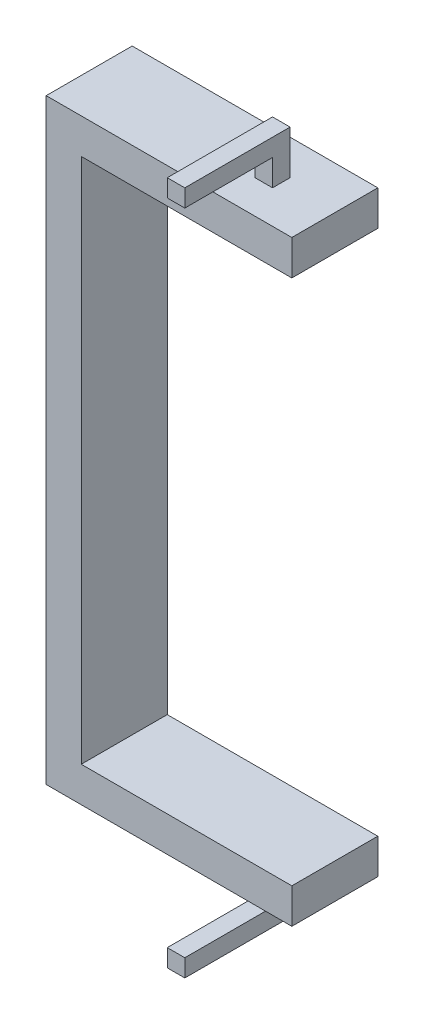
ISO-10303-21;
HEADER;
FILE_DESCRIPTION(('STEP AP214'),'2;1');
FILE_NAME('part.step','',(''),(''),'','','');
FILE_SCHEMA(('AUTOMOTIVE_DESIGN { 1 0 10303 214 1 1 1 1 }'));
ENDSEC;
DATA;
#1=APPLICATION_CONTEXT('core data for automotive mechanical design processes');
#2=APPLICATION_PROTOCOL_DEFINITION('international standard','automotive_design',2000,#1);
#3=PRODUCT_CONTEXT('',#1,'mechanical');
#4=PRODUCT('Part','Part','',(#3));
#5=PRODUCT_RELATED_PRODUCT_CATEGORY('part','',(#4));
#6=PRODUCT_DEFINITION_FORMATION('','',#4);
#7=PRODUCT_DEFINITION_CONTEXT('part definition',#1,'design');
#8=PRODUCT_DEFINITION('design','',#6,#7);
#9=PRODUCT_DEFINITION_SHAPE('','',#8);
#10=(LENGTH_UNIT() NAMED_UNIT(*) SI_UNIT(.MILLI.,.METRE.));
#11=(NAMED_UNIT(*) PLANE_ANGLE_UNIT() SI_UNIT($,.RADIAN.));
#12=(NAMED_UNIT(*) SI_UNIT($,.STERADIAN.) SOLID_ANGLE_UNIT());
#13=UNCERTAINTY_MEASURE_WITH_UNIT(LENGTH_MEASURE(1.E-05),#10,'distance_accuracy_value','');
#14=(GEOMETRIC_REPRESENTATION_CONTEXT(3) GLOBAL_UNCERTAINTY_ASSIGNED_CONTEXT((#13)) GLOBAL_UNIT_ASSIGNED_CONTEXT((#10,
#11,#12)) REPRESENTATION_CONTEXT('',''));
#15=CARTESIAN_POINT('',(0.,0.,0.));
#16=DIRECTION('',(0.,0.,1.));
#17=DIRECTION('',(1.,0.,0.));
#18=AXIS2_PLACEMENT_3D('',#15,#16,#17);
#19=CARTESIAN_POINT('',(0.,170.,-59.9999999999997));
#20=DIRECTION('',(0.,0.,1.));
#21=DIRECTION('',(1.,0.,0.));
#22=AXIS2_PLACEMENT_3D('',#19,#20,#21);
#23=PLANE('',#22);
#24=DIRECTION('',(0.,1.,0.));
#25=VECTOR('',#24,1.);
#26=CARTESIAN_POINT('',(140.,-160.,-59.9999999999997));
#27=LINE('',#26,#25);
#28=CARTESIAN_POINT('',(140.,-170.,-59.9999999999997));
#29=VERTEX_POINT('',#28);
#30=CARTESIAN_POINT('',(140.,-150.,-59.9999999999997));
#31=VERTEX_POINT('',#30);
#32=EDGE_CURVE('E46',#29,#31,#27,.T.);
#33=ORIENTED_EDGE('',*,*,#32,.F.);
#34=DIRECTION('',(1.,0.,0.));
#35=VECTOR('',#34,1.);
#36=CARTESIAN_POINT('',(70.,-170.,-59.9999999999997));
#37=LINE('',#36,#35);
#38=CARTESIAN_POINT('',(0.,-170.,-59.9999999999998));
#39=VERTEX_POINT('',#38);
#40=EDGE_CURVE('E190',#39,#29,#37,.T.);
#41=ORIENTED_EDGE('',*,*,#40,.F.);
#42=DIRECTION('',(0.,1.,0.));
#43=VECTOR('',#42,1.);
#44=CARTESIAN_POINT('',(0.,0.,-59.9999999999997));
#45=LINE('',#44,#43);
#46=CARTESIAN_POINT('',(0.,170.,-59.9999999999997));
#47=VERTEX_POINT('',#46);
#48=EDGE_CURVE('E196',#39,#47,#45,.T.);
#49=ORIENTED_EDGE('',*,*,#48,.T.);
#50=DIRECTION('',(1.,0.,0.));
#51=VECTOR('',#50,1.);
#52=CARTESIAN_POINT('',(70.,170.,-59.9999999999997));
#53=LINE('',#52,#51);
#54=CARTESIAN_POINT('',(140.,170.,-59.9999999999997));
#55=VERTEX_POINT('',#54);
#56=EDGE_CURVE('E210',#47,#55,#53,.T.);
#57=ORIENTED_EDGE('',*,*,#56,.T.);
#58=DIRECTION('',(0.,1.,0.));
#59=VECTOR('',#58,1.);
#60=CARTESIAN_POINT('',(140.,160.,-59.9999999999997));
#61=LINE('',#60,#59);
#62=CARTESIAN_POINT('',(140.,150.,-59.9999999999996));
#63=VERTEX_POINT('',#62);
#64=EDGE_CURVE('E220',#63,#55,#61,.T.);
#65=ORIENTED_EDGE('',*,*,#64,.F.);
#66=DIRECTION('',(1.,0.,0.));
#67=VECTOR('',#66,1.);
#68=CARTESIAN_POINT('',(80.,150.,-59.9999999999997));
#69=LINE('',#68,#67);
#70=CARTESIAN_POINT('',(20.,150.,-59.9999999999997));
#71=VERTEX_POINT('',#70);
#72=EDGE_CURVE('E223',#71,#63,#69,.T.);
#73=ORIENTED_EDGE('',*,*,#72,.F.);
#74=DIRECTION('',(0.,1.,0.));
#75=VECTOR('',#74,1.);
#76=CARTESIAN_POINT('',(20.,0.,-59.9999999999997));
#77=LINE('',#76,#75);
#78=CARTESIAN_POINT('',(20.,-150.,-59.9999999999997));
#79=VERTEX_POINT('',#78);
#80=EDGE_CURVE('E228',#79,#71,#77,.T.);
#81=ORIENTED_EDGE('',*,*,#80,.F.);
#82=DIRECTION('',(1.,0.,0.));
#83=VECTOR('',#82,1.);
#84=CARTESIAN_POINT('',(80.,-150.,-59.9999999999997));
#85=LINE('',#84,#83);
#86=EDGE_CURVE('E221',#79,#31,#85,.T.);
#87=ORIENTED_EDGE('',*,*,#86,.T.);
#88=EDGE_LOOP('',(#33,#41,#49,#57,#65,#73,#81,#87));
#89=FACE_BOUND('',#88,.T.);
#90=ADVANCED_FACE('F38',(#89),#23,.F.);
#91=CARTESIAN_POINT('',(140.,0.,0.));
#92=DIRECTION('',(1.,0.,0.));
#93=DIRECTION('',(0.,0.,-1.));
#94=AXIS2_PLACEMENT_3D('',#91,#92,#93);
#95=PLANE('',#94);
#96=DIRECTION('',(0.,1.,0.));
#97=VECTOR('',#96,1.);
#98=CARTESIAN_POINT('',(140.,0.,-10.9999999999997));
#99=LINE('',#98,#97);
#100=CARTESIAN_POINT('',(140.,-170.,-10.9999999999997));
#101=VERTEX_POINT('',#100);
#102=CARTESIAN_POINT('',(140.,-150.,-10.9999999999997));
#103=VERTEX_POINT('',#102);
#104=EDGE_CURVE('E173',#101,#103,#99,.T.);
#105=ORIENTED_EDGE('',*,*,#104,.F.);
#106=DIRECTION('',(0.,0.,-1.));
#107=VECTOR('',#106,1.);
#108=CARTESIAN_POINT('',(140.,-170.,-19.9999999999997));
#109=LINE('',#108,#107);
#110=EDGE_CURVE('E182',#101,#29,#109,.T.);
#111=ORIENTED_EDGE('',*,*,#110,.T.);
#112=ORIENTED_EDGE('',*,*,#32,.T.);
#113=DIRECTION('',(0.,0.,1.));
#114=VECTOR('',#113,1.);
#115=CARTESIAN_POINT('',(140.,-150.,-19.9999999999997));
#116=LINE('',#115,#114);
#117=EDGE_CURVE('E185',#31,#103,#116,.T.);
#118=ORIENTED_EDGE('',*,*,#117,.T.);
#119=EDGE_LOOP('',(#105,#111,#112,#118));
#120=FACE_BOUND('',#119,.T.);
#121=ADVANCED_FACE('F180',(#120),#95,.T.);
#122=CARTESIAN_POINT('',(20.,-150.,60.0000000000004));
#123=DIRECTION('',(0.,-1.,0.));
#124=DIRECTION('',(0.,0.,-1.));
#125=AXIS2_PLACEMENT_3D('',#122,#123,#124);
#126=PLANE('',#125);
#127=DIRECTION('',(0.,0.,1.));
#128=VECTOR('',#127,1.);
#129=CARTESIAN_POINT('',(20.,-150.,-19.9999999999996));
#130=LINE('',#129,#128);
#131=CARTESIAN_POINT('',(20.,-150.,-10.9999999999997));
#132=VERTEX_POINT('',#131);
#133=EDGE_CURVE('E203',#79,#132,#130,.T.);
#134=ORIENTED_EDGE('',*,*,#133,.T.);
#135=DIRECTION('',(1.,0.,0.));
#136=VECTOR('',#135,1.);
#137=CARTESIAN_POINT('',(20.,-150.,-10.9999999999997));
#138=LINE('',#137,#136);
#139=EDGE_CURVE('E187',#132,#103,#138,.T.);
#140=ORIENTED_EDGE('',*,*,#139,.T.);
#141=ORIENTED_EDGE('',*,*,#117,.F.);
#142=ORIENTED_EDGE('',*,*,#86,.F.);
#143=EDGE_LOOP('',(#134,#140,#141,#142));
#144=FACE_BOUND('',#143,.T.);
#145=ADVANCED_FACE('F245',(#144),#126,.F.);
#146=CARTESIAN_POINT('',(20.,0.,0.));
#147=DIRECTION('',(1.,0.,0.));
#148=DIRECTION('',(0.,0.,-1.));
#149=AXIS2_PLACEMENT_3D('',#146,#147,#148);
#150=PLANE('',#149);
#151=DIRECTION('',(0.,1.,0.));
#152=VECTOR('',#151,1.);
#153=CARTESIAN_POINT('',(20.,0.,-10.9999999999997));
#154=LINE('',#153,#152);
#155=CARTESIAN_POINT('',(20.,150.,-10.9999999999997));
#156=VERTEX_POINT('',#155);
#157=EDGE_CURVE('E243',#132,#156,#154,.T.);
#158=ORIENTED_EDGE('',*,*,#157,.F.);
#159=ORIENTED_EDGE('',*,*,#133,.F.);
#160=ORIENTED_EDGE('',*,*,#80,.T.);
#161=DIRECTION('',(0.,0.,-1.));
#162=VECTOR('',#161,1.);
#163=CARTESIAN_POINT('',(20.,150.,-19.9999999999996));
#164=LINE('',#163,#162);
#165=EDGE_CURVE('E206',#156,#71,#164,.T.);
#166=ORIENTED_EDGE('',*,*,#165,.F.);
#167=EDGE_LOOP('',(#158,#159,#160,#166));
#168=FACE_BOUND('',#167,.T.);
#169=ADVANCED_FACE('F242',(#168),#150,.T.);
#170=CARTESIAN_POINT('',(20.,150.,60.0000000000004));
#171=DIRECTION('',(0.,-1.,0.));
#172=DIRECTION('',(0.,0.,-1.));
#173=AXIS2_PLACEMENT_3D('',#170,#171,#172);
#174=PLANE('',#173);
#175=DIRECTION('',(1.,0.,0.));
#176=VECTOR('',#175,1.);
#177=CARTESIAN_POINT('',(20.,150.,-10.9999999999997));
#178=LINE('',#177,#176);
#179=CARTESIAN_POINT('',(140.,150.,-10.9999999999997));
#180=VERTEX_POINT('',#179);
#181=EDGE_CURVE('E247',#156,#180,#178,.T.);
#182=ORIENTED_EDGE('',*,*,#181,.F.);
#183=ORIENTED_EDGE('',*,*,#165,.T.);
#184=ORIENTED_EDGE('',*,*,#72,.T.);
#185=DIRECTION('',(0.,0.,-1.));
#186=VECTOR('',#185,1.);
#187=CARTESIAN_POINT('',(140.,150.,-19.9999999999997));
#188=LINE('',#187,#186);
#189=EDGE_CURVE('E207',#180,#63,#188,.T.);
#190=ORIENTED_EDGE('',*,*,#189,.F.);
#191=EDGE_LOOP('',(#182,#183,#184,#190));
#192=FACE_BOUND('',#191,.T.);
#193=ADVANCED_FACE('F236',(#192),#174,.T.);
#194=CARTESIAN_POINT('',(140.,0.,0.));
#195=DIRECTION('',(1.,0.,0.));
#196=DIRECTION('',(0.,0.,-1.));
#197=AXIS2_PLACEMENT_3D('',#194,#195,#196);
#198=PLANE('',#197);
#199=DIRECTION('',(0.,1.,0.));
#200=VECTOR('',#199,1.);
#201=CARTESIAN_POINT('',(140.,0.,-10.9999999999997));
#202=LINE('',#201,#200);
#203=CARTESIAN_POINT('',(140.,170.,-10.9999999999997));
#204=VERTEX_POINT('',#203);
#205=EDGE_CURVE('E376',#180,#204,#202,.T.);
#206=ORIENTED_EDGE('',*,*,#205,.F.);
#207=ORIENTED_EDGE('',*,*,#189,.T.);
#208=ORIENTED_EDGE('',*,*,#64,.T.);
#209=DIRECTION('',(0.,0.,1.));
#210=VECTOR('',#209,1.);
#211=CARTESIAN_POINT('',(140.,170.,-19.9999999999998));
#212=LINE('',#211,#210);
#213=EDGE_CURVE('E211',#55,#204,#212,.T.);
#214=ORIENTED_EDGE('',*,*,#213,.T.);
#215=EDGE_LOOP('',(#206,#207,#208,#214));
#216=FACE_BOUND('',#215,.T.);
#217=ADVANCED_FACE('F368',(#216),#198,.T.);
#218=CARTESIAN_POINT('',(0.,170.,59.9999999999998));
#219=DIRECTION('',(0.,-1.,0.));
#220=DIRECTION('',(0.,0.,-1.));
#221=AXIS2_PLACEMENT_3D('',#218,#219,#220);
#222=PLANE('',#221);
#223=DIRECTION('',(-1.,0.,0.));
#224=VECTOR('',#223,1.);
#225=CARTESIAN_POINT('',(110.,170.,-39.9999999999998));
#226=LINE('',#225,#224);
#227=CARTESIAN_POINT('',(110.,170.,-39.9999999999998));
#228=VERTEX_POINT('',#227);
#229=CARTESIAN_POINT('',(100.,170.,-39.9999999999998));
#230=VERTEX_POINT('',#229);
#231=EDGE_CURVE('E328',#228,#230,#226,.T.);
#232=ORIENTED_EDGE('',*,*,#231,.F.);
#233=DIRECTION('',(0.,0.,1.));
#234=VECTOR('',#233,1.);
#235=CARTESIAN_POINT('',(110.,170.,-39.9999999999998));
#236=LINE('',#235,#234);
#237=CARTESIAN_POINT('',(110.,170.,-29.9999999999998));
#238=VERTEX_POINT('',#237);
#239=EDGE_CURVE('E306',#228,#238,#236,.T.);
#240=ORIENTED_EDGE('',*,*,#239,.T.);
#241=DIRECTION('',(-1.,0.,0.));
#242=VECTOR('',#241,1.);
#243=CARTESIAN_POINT('',(110.,170.,-29.9999999999998));
#244=LINE('',#243,#242);
#245=CARTESIAN_POINT('',(100.,170.,-29.9999999999998));
#246=VERTEX_POINT('',#245);
#247=EDGE_CURVE('E331',#238,#246,#244,.T.);
#248=ORIENTED_EDGE('',*,*,#247,.T.);
#249=DIRECTION('',(0.,0.,1.));
#250=VECTOR('',#249,1.);
#251=CARTESIAN_POINT('',(100.,170.,-39.9999999999998));
#252=LINE('',#251,#250);
#253=EDGE_CURVE('E322',#230,#246,#252,.T.);
#254=ORIENTED_EDGE('',*,*,#253,.F.);
#255=EDGE_LOOP('',(#232,#240,#248,#254));
#256=FACE_BOUND('',#255,.T.);
#257=DIRECTION('',(0.,0.,1.));
#258=VECTOR('',#257,1.);
#259=CARTESIAN_POINT('',(0.,170.,-19.9999999999999));
#260=LINE('',#259,#258);
#261=CARTESIAN_POINT('',(0.,170.,-10.9999999999997));
#262=VERTEX_POINT('',#261);
#263=EDGE_CURVE('E192',#47,#262,#260,.T.);
#264=ORIENTED_EDGE('',*,*,#263,.T.);
#265=DIRECTION('',(1.,0.,0.));
#266=VECTOR('',#265,1.);
#267=CARTESIAN_POINT('',(0.,170.,-10.9999999999997));
#268=LINE('',#267,#266);
#269=EDGE_CURVE('E373',#262,#204,#268,.T.);
#270=ORIENTED_EDGE('',*,*,#269,.T.);
#271=ORIENTED_EDGE('',*,*,#213,.F.);
#272=ORIENTED_EDGE('',*,*,#56,.F.);
#273=EDGE_LOOP('',(#264,#270,#271,#272));
#274=FACE_BOUND('',#273,.T.);
#275=ADVANCED_FACE('F364',(#256,#274),#222,.F.);
#276=CARTESIAN_POINT('',(0.,0.,0.));
#277=DIRECTION('',(1.,0.,0.));
#278=DIRECTION('',(0.,0.,-1.));
#279=AXIS2_PLACEMENT_3D('',#276,#277,#278);
#280=PLANE('',#279);
#281=DIRECTION('',(0.,0.,-1.));
#282=VECTOR('',#281,1.);
#283=CARTESIAN_POINT('',(0.,-170.,-19.9999999999997));
#284=LINE('',#283,#282);
#285=CARTESIAN_POINT('',(0.,-170.,-10.9999999999997));
#286=VERTEX_POINT('',#285);
#287=EDGE_CURVE('E213',#286,#39,#284,.T.);
#288=ORIENTED_EDGE('',*,*,#287,.F.);
#289=DIRECTION('',(0.,1.,0.));
#290=VECTOR('',#289,1.);
#291=CARTESIAN_POINT('',(0.,0.,-10.9999999999997));
#292=LINE('',#291,#290);
#293=EDGE_CURVE('E53',#286,#262,#292,.T.);
#294=ORIENTED_EDGE('',*,*,#293,.T.);
#295=ORIENTED_EDGE('',*,*,#263,.F.);
#296=ORIENTED_EDGE('',*,*,#48,.F.);
#297=EDGE_LOOP('',(#288,#294,#295,#296));
#298=FACE_BOUND('',#297,.T.);
#299=ADVANCED_FACE('F367',(#298),#280,.F.);
#300=CARTESIAN_POINT('',(0.,-170.,-59.9999999999998));
#301=DIRECTION('',(0.,1.,0.));
#302=DIRECTION('',(0.,0.,1.));
#303=AXIS2_PLACEMENT_3D('',#300,#301,#302);
#304=PLANE('',#303);
#305=DIRECTION('',(-1.,0.,0.));
#306=VECTOR('',#305,1.);
#307=CARTESIAN_POINT('',(110.,-170.,-29.9999999999998));
#308=LINE('',#307,#306);
#309=CARTESIAN_POINT('',(110.,-170.,-29.9999999999998));
#310=VERTEX_POINT('',#309);
#311=CARTESIAN_POINT('',(100.,-170.,-29.9999999999998));
#312=VERTEX_POINT('',#311);
#313=EDGE_CURVE('E286',#310,#312,#308,.T.);
#314=ORIENTED_EDGE('',*,*,#313,.F.);
#315=DIRECTION('',(0.,0.,1.));
#316=VECTOR('',#315,1.);
#317=CARTESIAN_POINT('',(110.,-170.,-39.9999999999998));
#318=LINE('',#317,#316);
#319=CARTESIAN_POINT('',(110.,-170.,-39.9999999999998));
#320=VERTEX_POINT('',#319);
#321=EDGE_CURVE('E60',#320,#310,#318,.T.);
#322=ORIENTED_EDGE('',*,*,#321,.F.);
#323=DIRECTION('',(-1.,0.,0.));
#324=VECTOR('',#323,1.);
#325=CARTESIAN_POINT('',(110.,-170.,-39.9999999999998));
#326=LINE('',#325,#324);
#327=CARTESIAN_POINT('',(100.,-170.,-39.9999999999998));
#328=VERTEX_POINT('',#327);
#329=EDGE_CURVE('E289',#320,#328,#326,.T.);
#330=ORIENTED_EDGE('',*,*,#329,.T.);
#331=DIRECTION('',(0.,0.,1.));
#332=VECTOR('',#331,1.);
#333=CARTESIAN_POINT('',(100.,-170.,-39.9999999999998));
#334=LINE('',#333,#332);
#335=EDGE_CURVE('E271',#328,#312,#334,.T.);
#336=ORIENTED_EDGE('',*,*,#335,.T.);
#337=EDGE_LOOP('',(#314,#322,#330,#336));
#338=FACE_BOUND('',#337,.T.);
#339=ORIENTED_EDGE('',*,*,#110,.F.);
#340=DIRECTION('',(-1.,0.,0.));
#341=VECTOR('',#340,1.);
#342=CARTESIAN_POINT('',(0.,-170.,-10.9999999999997));
#343=LINE('',#342,#341);
#344=EDGE_CURVE('E11',#101,#286,#343,.T.);
#345=ORIENTED_EDGE('',*,*,#344,.T.);
#346=ORIENTED_EDGE('',*,*,#287,.T.);
#347=ORIENTED_EDGE('',*,*,#40,.T.);
#348=EDGE_LOOP('',(#339,#345,#346,#347));
#349=FACE_BOUND('',#348,.T.);
#350=ADVANCED_FACE('F40',(#338,#349),#304,.F.);
#351=CARTESIAN_POINT('',(110.,195.,-29.9999999999998));
#352=DIRECTION('',(0.,-1.,0.));
#353=DIRECTION('',(0.,0.,-1.));
#354=AXIS2_PLACEMENT_3D('',#351,#352,#353);
#355=PLANE('',#354);
#356=DIRECTION('',(0.,0.,-1.));
#357=VECTOR('',#356,1.);
#358=CARTESIAN_POINT('',(100.,195.,-29.9999999999998));
#359=LINE('',#358,#357);
#360=CARTESIAN_POINT('',(100.,195.,-39.9999999999998));
#361=VERTEX_POINT('',#360);
#362=CARTESIAN_POINT('',(100.,195.,20.0000000000002));
#363=VERTEX_POINT('',#362);
#364=EDGE_CURVE('E293',#361,#363,#359,.F.);
#365=ORIENTED_EDGE('',*,*,#364,.T.);
#366=DIRECTION('',(-1.,0.,0.));
#367=VECTOR('',#366,1.);
#368=CARTESIAN_POINT('',(110.,195.,20.0000000000002));
#369=LINE('',#368,#367);
#370=CARTESIAN_POINT('',(110.,195.,20.0000000000002));
#371=VERTEX_POINT('',#370);
#372=EDGE_CURVE('E193',#371,#363,#369,.T.);
#373=ORIENTED_EDGE('',*,*,#372,.F.);
#374=DIRECTION('',(0.,0.,-1.));
#375=VECTOR('',#374,1.);
#376=CARTESIAN_POINT('',(110.,195.,-29.9999999999998));
#377=LINE('',#376,#375);
#378=CARTESIAN_POINT('',(110.,195.,-39.9999999999998));
#379=VERTEX_POINT('',#378);
#380=EDGE_CURVE('E294',#379,#371,#377,.F.);
#381=ORIENTED_EDGE('',*,*,#380,.F.);
#382=DIRECTION('',(-1.,0.,0.));
#383=VECTOR('',#382,1.);
#384=CARTESIAN_POINT('',(110.,195.,-39.9999999999998));
#385=LINE('',#384,#383);
#386=EDGE_CURVE('E310',#379,#361,#385,.T.);
#387=ORIENTED_EDGE('',*,*,#386,.T.);
#388=EDGE_LOOP('',(#365,#373,#381,#387));
#389=FACE_BOUND('',#388,.T.);
#390=ADVANCED_FACE('F360',(#389),#355,.F.);
#391=CARTESIAN_POINT('',(110.,185.,20.0000000000002));
#392=DIRECTION('',(0.,0.,1.));
#393=DIRECTION('',(1.,0.,0.));
#394=AXIS2_PLACEMENT_3D('',#391,#392,#393);
#395=PLANE('',#394);
#396=DIRECTION('',(0.,1.,0.));
#397=VECTOR('',#396,1.);
#398=CARTESIAN_POINT('',(100.,185.,20.0000000000002));
#399=LINE('',#398,#397);
#400=CARTESIAN_POINT('',(100.,185.,20.0000000000002));
#401=VERTEX_POINT('',#400);
#402=EDGE_CURVE('E313',#401,#363,#399,.T.);
#403=ORIENTED_EDGE('',*,*,#402,.F.);
#404=DIRECTION('',(-1.,0.,0.));
#405=VECTOR('',#404,1.);
#406=CARTESIAN_POINT('',(110.,185.,20.0000000000002));
#407=LINE('',#406,#405);
#408=CARTESIAN_POINT('',(110.,185.,20.0000000000002));
#409=VERTEX_POINT('',#408);
#410=EDGE_CURVE('E198',#409,#401,#407,.T.);
#411=ORIENTED_EDGE('',*,*,#410,.F.);
#412=DIRECTION('',(0.,1.,0.));
#413=VECTOR('',#412,1.);
#414=CARTESIAN_POINT('',(110.,185.,20.0000000000002));
#415=LINE('',#414,#413);
#416=EDGE_CURVE('E296',#409,#371,#415,.T.);
#417=ORIENTED_EDGE('',*,*,#416,.T.);
#418=ORIENTED_EDGE('',*,*,#372,.T.);
#419=EDGE_LOOP('',(#403,#411,#417,#418));
#420=FACE_BOUND('',#419,.T.);
#421=ADVANCED_FACE('F342',(#420),#395,.T.);
#422=CARTESIAN_POINT('',(110.,185.,-29.9999999999998));
#423=DIRECTION('',(0.,-1.,0.));
#424=DIRECTION('',(0.,0.,-1.));
#425=AXIS2_PLACEMENT_3D('',#422,#423,#424);
#426=PLANE('',#425);
#427=DIRECTION('',(0.,0.,1.));
#428=VECTOR('',#427,1.);
#429=CARTESIAN_POINT('',(100.,185.,-29.9999999999998));
#430=LINE('',#429,#428);
#431=CARTESIAN_POINT('',(100.,185.,-29.9999999999998));
#432=VERTEX_POINT('',#431);
#433=EDGE_CURVE('E316',#432,#401,#430,.T.);
#434=ORIENTED_EDGE('',*,*,#433,.F.);
#435=DIRECTION('',(-1.,0.,0.));
#436=VECTOR('',#435,1.);
#437=CARTESIAN_POINT('',(110.,185.,-29.9999999999998));
#438=LINE('',#437,#436);
#439=CARTESIAN_POINT('',(110.,185.,-29.9999999999998));
#440=VERTEX_POINT('',#439);
#441=EDGE_CURVE('E333',#440,#432,#438,.T.);
#442=ORIENTED_EDGE('',*,*,#441,.F.);
#443=DIRECTION('',(0.,0.,1.));
#444=VECTOR('',#443,1.);
#445=CARTESIAN_POINT('',(110.,185.,-29.9999999999998));
#446=LINE('',#445,#444);
#447=EDGE_CURVE('E300',#440,#409,#446,.T.);
#448=ORIENTED_EDGE('',*,*,#447,.T.);
#449=ORIENTED_EDGE('',*,*,#410,.T.);
#450=EDGE_LOOP('',(#434,#442,#448,#449));
#451=FACE_BOUND('',#450,.T.);
#452=ADVANCED_FACE('F338',(#451),#426,.T.);
#453=CARTESIAN_POINT('',(110.,170.,-29.9999999999998));
#454=DIRECTION('',(0.,0.,1.));
#455=DIRECTION('',(1.,0.,0.));
#456=AXIS2_PLACEMENT_3D('',#453,#454,#455);
#457=PLANE('',#456);
#458=DIRECTION('',(0.,1.,0.));
#459=VECTOR('',#458,1.);
#460=CARTESIAN_POINT('',(100.,170.,-29.9999999999998));
#461=LINE('',#460,#459);
#462=EDGE_CURVE('E319',#246,#432,#461,.T.);
#463=ORIENTED_EDGE('',*,*,#462,.F.);
#464=ORIENTED_EDGE('',*,*,#247,.F.);
#465=DIRECTION('',(0.,1.,0.));
#466=VECTOR('',#465,1.);
#467=CARTESIAN_POINT('',(110.,170.,-29.9999999999998));
#468=LINE('',#467,#466);
#469=EDGE_CURVE('E303',#238,#440,#468,.T.);
#470=ORIENTED_EDGE('',*,*,#469,.T.);
#471=ORIENTED_EDGE('',*,*,#441,.T.);
#472=EDGE_LOOP('',(#463,#464,#470,#471));
#473=FACE_BOUND('',#472,.T.);
#474=ADVANCED_FACE('F351',(#473),#457,.T.);
#475=CARTESIAN_POINT('',(110.,170.,-39.9999999999998));
#476=DIRECTION('',(0.,0.,1.));
#477=DIRECTION('',(1.,0.,0.));
#478=AXIS2_PLACEMENT_3D('',#475,#476,#477);
#479=PLANE('',#478);
#480=DIRECTION('',(0.,1.,0.));
#481=VECTOR('',#480,1.);
#482=CARTESIAN_POINT('',(100.,170.,-39.9999999999998));
#483=LINE('',#482,#481);
#484=EDGE_CURVE('E297',#230,#361,#483,.T.);
#485=ORIENTED_EDGE('',*,*,#484,.T.);
#486=ORIENTED_EDGE('',*,*,#386,.F.);
#487=DIRECTION('',(0.,1.,0.));
#488=VECTOR('',#487,1.);
#489=CARTESIAN_POINT('',(110.,170.,-39.9999999999998));
#490=LINE('',#489,#488);
#491=EDGE_CURVE('E308',#228,#379,#490,.T.);
#492=ORIENTED_EDGE('',*,*,#491,.F.);
#493=ORIENTED_EDGE('',*,*,#231,.T.);
#494=EDGE_LOOP('',(#485,#486,#492,#493));
#495=FACE_BOUND('',#494,.T.);
#496=ADVANCED_FACE('F362',(#495),#479,.F.);
#497=CARTESIAN_POINT('',(110.,0.,0.));
#498=DIRECTION('',(1.,0.,0.));
#499=DIRECTION('',(0.,0.,-1.));
#500=AXIS2_PLACEMENT_3D('',#497,#498,#499);
#501=PLANE('',#500);
#502=ORIENTED_EDGE('',*,*,#380,.T.);
#503=ORIENTED_EDGE('',*,*,#416,.F.);
#504=ORIENTED_EDGE('',*,*,#447,.F.);
#505=ORIENTED_EDGE('',*,*,#469,.F.);
#506=ORIENTED_EDGE('',*,*,#239,.F.);
#507=ORIENTED_EDGE('',*,*,#491,.T.);
#508=EDGE_LOOP('',(#502,#503,#504,#505,#506,#507));
#509=FACE_BOUND('',#508,.T.);
#510=ADVANCED_FACE('F354',(#509),#501,.T.);
#511=CARTESIAN_POINT('',(100.,0.,0.));
#512=DIRECTION('',(1.,0.,0.));
#513=DIRECTION('',(0.,0.,-1.));
#514=AXIS2_PLACEMENT_3D('',#511,#512,#513);
#515=PLANE('',#514);
#516=ORIENTED_EDGE('',*,*,#364,.F.);
#517=ORIENTED_EDGE('',*,*,#484,.F.);
#518=ORIENTED_EDGE('',*,*,#253,.T.);
#519=ORIENTED_EDGE('',*,*,#462,.T.);
#520=ORIENTED_EDGE('',*,*,#433,.T.);
#521=ORIENTED_EDGE('',*,*,#402,.T.);
#522=EDGE_LOOP('',(#516,#517,#518,#519,#520,#521));
#523=FACE_BOUND('',#522,.T.);
#524=ADVANCED_FACE('F346',(#523),#515,.F.);
#525=CARTESIAN_POINT('',(110.,-195.,-29.9999999999998));
#526=DIRECTION('',(0.,-1.,0.));
#527=DIRECTION('',(0.,0.,-1.));
#528=AXIS2_PLACEMENT_3D('',#525,#526,#527);
#529=PLANE('',#528);
#530=DIRECTION('',(0.,0.,-1.));
#531=VECTOR('',#530,1.);
#532=CARTESIAN_POINT('',(100.,-195.,-29.9999999999998));
#533=LINE('',#532,#531);
#534=CARTESIAN_POINT('',(100.,-195.,-39.9999999999998));
#535=VERTEX_POINT('',#534);
#536=CARTESIAN_POINT('',(100.,-195.,20.0000000000002));
#537=VERTEX_POINT('',#536);
#538=EDGE_CURVE('E186',#535,#537,#533,.F.);
#539=ORIENTED_EDGE('',*,*,#538,.F.);
#540=DIRECTION('',(-1.,0.,0.));
#541=VECTOR('',#540,1.);
#542=CARTESIAN_POINT('',(110.,-195.,-39.9999999999998));
#543=LINE('',#542,#541);
#544=CARTESIAN_POINT('',(110.,-195.,-39.9999999999998));
#545=VERTEX_POINT('',#544);
#546=EDGE_CURVE('E291',#545,#535,#543,.T.);
#547=ORIENTED_EDGE('',*,*,#546,.F.);
#548=DIRECTION('',(0.,0.,-1.));
#549=VECTOR('',#548,1.);
#550=CARTESIAN_POINT('',(110.,-195.,-29.9999999999998));
#551=LINE('',#550,#549);
#552=CARTESIAN_POINT('',(110.,-195.,20.0000000000002));
#553=VERTEX_POINT('',#552);
#554=EDGE_CURVE('E251',#545,#553,#551,.F.);
#555=ORIENTED_EDGE('',*,*,#554,.T.);
#556=DIRECTION('',(-1.,0.,0.));
#557=VECTOR('',#556,1.);
#558=CARTESIAN_POINT('',(110.,-195.,20.0000000000002));
#559=LINE('',#558,#557);
#560=EDGE_CURVE('E265',#553,#537,#559,.T.);
#561=ORIENTED_EDGE('',*,*,#560,.T.);
#562=EDGE_LOOP('',(#539,#547,#555,#561));
#563=FACE_BOUND('',#562,.T.);
#564=ADVANCED_FACE('F491',(#563),#529,.T.);
#565=CARTESIAN_POINT('',(110.,-170.,-39.9999999999998));
#566=DIRECTION('',(0.,0.,-1.));
#567=DIRECTION('',(-1.,0.,0.));
#568=AXIS2_PLACEMENT_3D('',#565,#566,#567);
#569=PLANE('',#568);
#570=DIRECTION('',(0.,-1.,0.));
#571=VECTOR('',#570,1.);
#572=CARTESIAN_POINT('',(100.,-170.,-39.9999999999998));
#573=LINE('',#572,#571);
#574=EDGE_CURVE('E268',#328,#535,#573,.T.);
#575=ORIENTED_EDGE('',*,*,#574,.F.);
#576=ORIENTED_EDGE('',*,*,#329,.F.);
#577=DIRECTION('',(0.,-1.,0.));
#578=VECTOR('',#577,1.);
#579=CARTESIAN_POINT('',(110.,-170.,-39.9999999999998));
#580=LINE('',#579,#578);
#581=EDGE_CURVE('E254',#320,#545,#580,.T.);
#582=ORIENTED_EDGE('',*,*,#581,.T.);
#583=ORIENTED_EDGE('',*,*,#546,.T.);
#584=EDGE_LOOP('',(#575,#576,#582,#583));
#585=FACE_BOUND('',#584,.T.);
#586=ADVANCED_FACE('F483',(#585),#569,.T.);
#587=CARTESIAN_POINT('',(110.,-170.,-29.9999999999998));
#588=DIRECTION('',(0.,0.,-1.));
#589=DIRECTION('',(-1.,0.,0.));
#590=AXIS2_PLACEMENT_3D('',#587,#588,#589);
#591=PLANE('',#590);
#592=DIRECTION('',(0.,-1.,0.));
#593=VECTOR('',#592,1.);
#594=CARTESIAN_POINT('',(100.,-170.,-29.9999999999998));
#595=LINE('',#594,#593);
#596=CARTESIAN_POINT('',(100.,-185.,-29.9999999999998));
#597=VERTEX_POINT('',#596);
#598=EDGE_CURVE('E273',#312,#597,#595,.T.);
#599=ORIENTED_EDGE('',*,*,#598,.T.);
#600=DIRECTION('',(-1.,0.,0.));
#601=VECTOR('',#600,1.);
#602=CARTESIAN_POINT('',(110.,-185.,-29.9999999999998));
#603=LINE('',#602,#601);
#604=CARTESIAN_POINT('',(110.,-185.,-29.9999999999998));
#605=VERTEX_POINT('',#604);
#606=EDGE_CURVE('E283',#605,#597,#603,.T.);
#607=ORIENTED_EDGE('',*,*,#606,.F.);
#608=DIRECTION('',(0.,-1.,0.));
#609=VECTOR('',#608,1.);
#610=CARTESIAN_POINT('',(110.,-170.,-29.9999999999998));
#611=LINE('',#610,#609);
#612=EDGE_CURVE('E259',#310,#605,#611,.T.);
#613=ORIENTED_EDGE('',*,*,#612,.F.);
#614=ORIENTED_EDGE('',*,*,#313,.T.);
#615=EDGE_LOOP('',(#599,#607,#613,#614));
#616=FACE_BOUND('',#615,.T.);
#617=ADVANCED_FACE('F475',(#616),#591,.F.);
#618=CARTESIAN_POINT('',(110.,-185.,-29.9999999999998));
#619=DIRECTION('',(0.,-1.,0.));
#620=DIRECTION('',(0.,0.,-1.));
#621=AXIS2_PLACEMENT_3D('',#618,#619,#620);
#622=PLANE('',#621);
#623=DIRECTION('',(0.,0.,1.));
#624=VECTOR('',#623,1.);
#625=CARTESIAN_POINT('',(100.,-185.,-29.9999999999998));
#626=LINE('',#625,#624);
#627=CARTESIAN_POINT('',(100.,-185.,20.0000000000002));
#628=VERTEX_POINT('',#627);
#629=EDGE_CURVE('E275',#597,#628,#626,.T.);
#630=ORIENTED_EDGE('',*,*,#629,.T.);
#631=DIRECTION('',(-1.,0.,0.));
#632=VECTOR('',#631,1.);
#633=CARTESIAN_POINT('',(110.,-185.,20.0000000000002));
#634=LINE('',#633,#632);
#635=CARTESIAN_POINT('',(110.,-185.,20.0000000000002));
#636=VERTEX_POINT('',#635);
#637=EDGE_CURVE('E280',#636,#628,#634,.T.);
#638=ORIENTED_EDGE('',*,*,#637,.F.);
#639=DIRECTION('',(0.,0.,1.));
#640=VECTOR('',#639,1.);
#641=CARTESIAN_POINT('',(110.,-185.,-29.9999999999998));
#642=LINE('',#641,#640);
#643=EDGE_CURVE('E261',#605,#636,#642,.T.);
#644=ORIENTED_EDGE('',*,*,#643,.F.);
#645=ORIENTED_EDGE('',*,*,#606,.T.);
#646=EDGE_LOOP('',(#630,#638,#644,#645));
#647=FACE_BOUND('',#646,.T.);
#648=ADVANCED_FACE('F467',(#647),#622,.F.);
#649=CARTESIAN_POINT('',(110.,-185.,20.0000000000002));
#650=DIRECTION('',(0.,0.,-1.));
#651=DIRECTION('',(-1.,0.,0.));
#652=AXIS2_PLACEMENT_3D('',#649,#650,#651);
#653=PLANE('',#652);
#654=DIRECTION('',(0.,-1.,0.));
#655=VECTOR('',#654,1.);
#656=CARTESIAN_POINT('',(100.,-185.,20.0000000000002));
#657=LINE('',#656,#655);
#658=EDGE_CURVE('E255',#628,#537,#657,.T.);
#659=ORIENTED_EDGE('',*,*,#658,.T.);
#660=ORIENTED_EDGE('',*,*,#560,.F.);
#661=DIRECTION('',(0.,-1.,0.));
#662=VECTOR('',#661,1.);
#663=CARTESIAN_POINT('',(110.,-185.,20.0000000000002));
#664=LINE('',#663,#662);
#665=EDGE_CURVE('E263',#636,#553,#664,.T.);
#666=ORIENTED_EDGE('',*,*,#665,.F.);
#667=ORIENTED_EDGE('',*,*,#637,.T.);
#668=EDGE_LOOP('',(#659,#660,#666,#667));
#669=FACE_BOUND('',#668,.T.);
#670=ADVANCED_FACE('F459',(#669),#653,.F.);
#671=CARTESIAN_POINT('',(110.,0.,0.));
#672=DIRECTION('',(1.,0.,0.));
#673=DIRECTION('',(0.,0.,-1.));
#674=AXIS2_PLACEMENT_3D('',#671,#672,#673);
#675=PLANE('',#674);
#676=ORIENTED_EDGE('',*,*,#554,.F.);
#677=ORIENTED_EDGE('',*,*,#581,.F.);
#678=ORIENTED_EDGE('',*,*,#321,.T.);
#679=ORIENTED_EDGE('',*,*,#612,.T.);
#680=ORIENTED_EDGE('',*,*,#643,.T.);
#681=ORIENTED_EDGE('',*,*,#665,.T.);
#682=EDGE_LOOP('',(#676,#677,#678,#679,#680,#681));
#683=FACE_BOUND('',#682,.T.);
#684=ADVANCED_FACE('F451',(#683),#675,.T.);
#685=CARTESIAN_POINT('',(100.,0.,0.));
#686=DIRECTION('',(1.,0.,0.));
#687=DIRECTION('',(0.,0.,-1.));
#688=AXIS2_PLACEMENT_3D('',#685,#686,#687);
#689=PLANE('',#688);
#690=ORIENTED_EDGE('',*,*,#538,.T.);
#691=ORIENTED_EDGE('',*,*,#658,.F.);
#692=ORIENTED_EDGE('',*,*,#629,.F.);
#693=ORIENTED_EDGE('',*,*,#598,.F.);
#694=ORIENTED_EDGE('',*,*,#335,.F.);
#695=ORIENTED_EDGE('',*,*,#574,.T.);
#696=EDGE_LOOP('',(#690,#691,#692,#693,#694,#695));
#697=FACE_BOUND('',#696,.T.);
#698=ADVANCED_FACE('F441',(#697),#689,.F.);
#699=CARTESIAN_POINT('',(0.,0.,-10.9999999999997));
#700=DIRECTION('',(0.,0.,-1.));
#701=DIRECTION('',(-1.,0.,0.));
#702=AXIS2_PLACEMENT_3D('',#699,#700,#701);
#703=PLANE('',#702);
#704=ORIENTED_EDGE('',*,*,#104,.T.);
#705=ORIENTED_EDGE('',*,*,#139,.F.);
#706=ORIENTED_EDGE('',*,*,#157,.T.);
#707=ORIENTED_EDGE('',*,*,#181,.T.);
#708=ORIENTED_EDGE('',*,*,#205,.T.);
#709=ORIENTED_EDGE('',*,*,#269,.F.);
#710=ORIENTED_EDGE('',*,*,#293,.F.);
#711=ORIENTED_EDGE('',*,*,#344,.F.);
#712=EDGE_LOOP('',(#704,#705,#706,#707,#708,#709,#710,#711));
#713=FACE_BOUND('',#712,.T.);
#714=ADVANCED_FACE('F172',(#713),#703,.F.);
#715=CLOSED_SHELL('',(#90,#121,#145,#169,#193,#217,#275,#299,#350,#390,#421,#452,#474,#496,#510,
#524,#564,#586,#617,#648,#670,#684,#698,#714));
#716=MANIFOLD_SOLID_BREP('B2',#715);
#717=ADVANCED_BREP_SHAPE_REPRESENTATION('',(#18,#716),#14);
#718=SHAPE_DEFINITION_REPRESENTATION(#9,#717);
ENDSEC;
END-ISO-10303-21;
